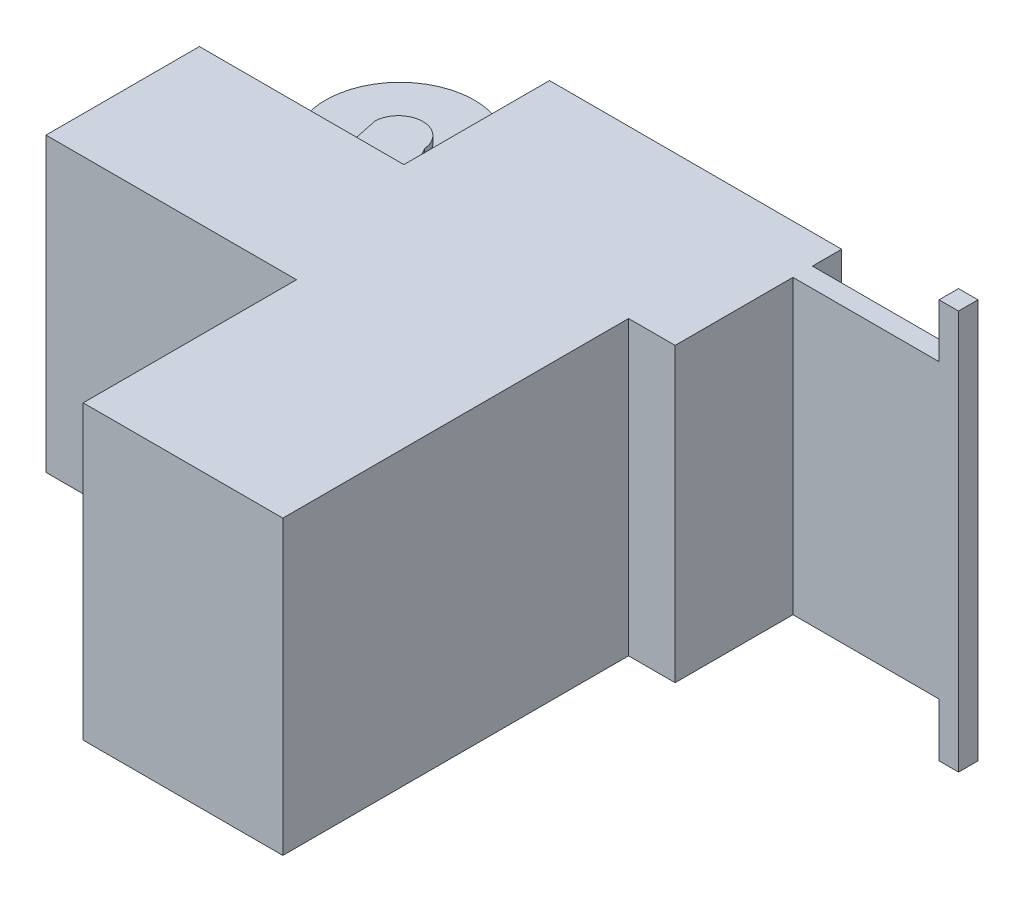
ISO-10303-21;
HEADER;
FILE_DESCRIPTION(('STEP AP214'),'2;1');
FILE_NAME('part.step','',(''),(''),'','','');
FILE_SCHEMA(('AUTOMOTIVE_DESIGN { 1 0 10303 214 1 1 1 1 }'));
ENDSEC;
DATA;
#1=APPLICATION_CONTEXT('core data for automotive mechanical design processes');
#2=APPLICATION_PROTOCOL_DEFINITION('international standard','automotive_design',2000,#1);
#3=PRODUCT_CONTEXT('',#1,'mechanical');
#4=PRODUCT('Part','Part','',(#3));
#5=PRODUCT_RELATED_PRODUCT_CATEGORY('part','',(#4));
#6=PRODUCT_DEFINITION_FORMATION('','',#4);
#7=PRODUCT_DEFINITION_CONTEXT('part definition',#1,'design');
#8=PRODUCT_DEFINITION('design','',#6,#7);
#9=PRODUCT_DEFINITION_SHAPE('','',#8);
#10=(LENGTH_UNIT() NAMED_UNIT(*) SI_UNIT(.MILLI.,.METRE.));
#11=(NAMED_UNIT(*) PLANE_ANGLE_UNIT() SI_UNIT($,.RADIAN.));
#12=(NAMED_UNIT(*) SI_UNIT($,.STERADIAN.) SOLID_ANGLE_UNIT());
#13=UNCERTAINTY_MEASURE_WITH_UNIT(LENGTH_MEASURE(1.E-05),#10,'distance_accuracy_value','');
#14=(GEOMETRIC_REPRESENTATION_CONTEXT(3) GLOBAL_UNCERTAINTY_ASSIGNED_CONTEXT((#13)) GLOBAL_UNIT_ASSIGNED_CONTEXT((#10,
#11,#12)) REPRESENTATION_CONTEXT('',''));
#15=CARTESIAN_POINT('',(0.,0.,0.));
#16=DIRECTION('',(0.,0.,1.));
#17=DIRECTION('',(1.,0.,0.));
#18=AXIS2_PLACEMENT_3D('',#15,#16,#17);
#19=CARTESIAN_POINT('',(-422.,-187.136600778184,-63.2222791750632));
#20=DIRECTION('',(0.,1.19069106426413E-12,-1.));
#21=DIRECTION('',(0.,1.,1.19069106426413E-12));
#22=AXIS2_PLACEMENT_3D('',#19,#20,#21);
#23=PLANE('',#22);
#24=DIRECTION('',(1.,0.,0.));
#25=VECTOR('',#24,1.);
#26=CARTESIAN_POINT('',(-422.,112.863399221816,-63.222279174706));
#27=LINE('',#26,#25);
#28=CARTESIAN_POINT('',(-422.,112.863399221816,-63.222279174706));
#29=VERTEX_POINT('',#28);
#30=CARTESIAN_POINT('',(-212.,112.863399221816,-63.2222791748846));
#31=VERTEX_POINT('',#30);
#32=EDGE_CURVE('E458',#29,#31,#27,.T.);
#33=ORIENTED_EDGE('',*,*,#32,.T.);
#34=DIRECTION('',(0.,-1.,-1.19069106426413E-12));
#35=VECTOR('',#34,1.);
#36=CARTESIAN_POINT('',(-212.,112.863399221816,-63.222279174706));
#37=LINE('',#36,#35);
#38=CARTESIAN_POINT('',(-212.,-187.136600778184,-63.2222791750632));
#39=VERTEX_POINT('',#38);
#40=EDGE_CURVE('E439',#31,#39,#37,.T.);
#41=ORIENTED_EDGE('',*,*,#40,.T.);
#42=DIRECTION('',(-1.,0.,0.));
#43=VECTOR('',#42,1.);
#44=CARTESIAN_POINT('',(-212.,-187.136600778184,-63.2222791750632));
#45=LINE('',#44,#43);
#46=CARTESIAN_POINT('',(-422.,-187.136600778184,-63.2222791750632));
#47=VERTEX_POINT('',#46);
#48=EDGE_CURVE('E433',#39,#47,#45,.T.);
#49=ORIENTED_EDGE('',*,*,#48,.T.);
#50=DIRECTION('',(0.,1.,1.19069106426413E-12));
#51=VECTOR('',#50,1.);
#52=CARTESIAN_POINT('',(-422.,-187.136600778184,-63.2222791750632));
#53=LINE('',#52,#51);
#54=EDGE_CURVE('E429',#47,#29,#53,.T.);
#55=ORIENTED_EDGE('',*,*,#54,.T.);
#56=EDGE_LOOP('',(#33,#41,#49,#55));
#57=FACE_BOUND('',#56,.T.);
#58=DIRECTION('',(0.,1.,1.1906985813992E-12));
#59=VECTOR('',#58,1.);
#60=CARTESIAN_POINT('',(-353.96039145,-37.1366007782101,-63.2222791748846));
#61=LINE('',#60,#59);
#62=CARTESIAN_POINT('',(-353.96039145,-97.13660077821,-63.2222791749561));
#63=VERTEX_POINT('',#62);
#64=CARTESIAN_POINT('',(-353.96039145,22.86339922179,-63.2222791748132));
#65=VERTEX_POINT('',#64);
#66=EDGE_CURVE('E1099',#63,#65,#61,.T.);
#67=ORIENTED_EDGE('',*,*,#66,.F.);
#68=DIRECTION('',(-1.,0.,0.));
#69=VECTOR('',#68,1.);
#70=CARTESIAN_POINT('',(-353.96039145,-97.1366007782101,-63.2222791749561));
#71=LINE('',#70,#69);
#72=CARTESIAN_POINT('',(-233.96039145,-97.1366007782101,-63.222279174956));
#73=VERTEX_POINT('',#72);
#74=EDGE_CURVE('E1097',#73,#63,#71,.T.);
#75=ORIENTED_EDGE('',*,*,#74,.F.);
#76=DIRECTION('',(0.,-1.,-1.1906985813992E-12));
#77=VECTOR('',#76,1.);
#78=CARTESIAN_POINT('',(-233.96039145,-97.1366007782101,-63.2222791749561));
#79=LINE('',#78,#77);
#80=CARTESIAN_POINT('',(-233.96039145,22.8633992218185,-63.2222791748132));
#81=VERTEX_POINT('',#80);
#82=EDGE_CURVE('E1080',#81,#73,#79,.T.);
#83=ORIENTED_EDGE('',*,*,#82,.F.);
#84=DIRECTION('',(1.,0.,0.));
#85=VECTOR('',#84,1.);
#86=CARTESIAN_POINT('',(-233.96039145,22.8633992217899,-63.2222791748132));
#87=LINE('',#86,#85);
#88=EDGE_CURVE('E405',#65,#81,#87,.T.);
#89=ORIENTED_EDGE('',*,*,#88,.F.);
#90=EDGE_LOOP('',(#67,#75,#83,#89));
#91=FACE_BOUND('',#90,.T.);
#92=ADVANCED_FACE('F45',(#57,#91),#23,.T.);
#93=CARTESIAN_POINT('',(88.,-187.136600778006,-212.722279175063));
#94=DIRECTION('',(0.,-1.1906985813992E-12,1.));
#95=DIRECTION('',(0.,-1.,-1.1906985813992E-12));
#96=AXIS2_PLACEMENT_3D('',#93,#94,#95);
#97=PLANE('',#96);
#98=DIRECTION('',(-1.,0.,0.));
#99=VECTOR('',#98,1.);
#100=CARTESIAN_POINT('',(88.,112.863399221994,-212.722279174706));
#101=LINE('',#100,#99);
#102=CARTESIAN_POINT('',(88.,112.863399221994,-212.722279174706));
#103=VERTEX_POINT('',#102);
#104=CARTESIAN_POINT('',(-212.,112.863399221994,-212.722279174706));
#105=VERTEX_POINT('',#104);
#106=EDGE_CURVE('E54',#103,#105,#101,.T.);
#107=ORIENTED_EDGE('',*,*,#106,.F.);
#108=DIRECTION('',(0.,1.,1.1906985813992E-12));
#109=VECTOR('',#108,1.);
#110=CARTESIAN_POINT('',(88.,-187.136600778006,-212.722279175063));
#111=LINE('',#110,#109);
#112=CARTESIAN_POINT('',(88.,-187.136600778006,-212.722279175063));
#113=VERTEX_POINT('',#112);
#114=EDGE_CURVE('E489',#113,#103,#111,.T.);
#115=ORIENTED_EDGE('',*,*,#114,.F.);
#116=DIRECTION('',(-1.,0.,0.));
#117=VECTOR('',#116,1.);
#118=CARTESIAN_POINT('',(88.,-187.136600778006,-212.722279175063));
#119=LINE('',#118,#117);
#120=CARTESIAN_POINT('',(-212.,-187.136600778006,-212.722279175063));
#121=VERTEX_POINT('',#120);
#122=EDGE_CURVE('E12',#113,#121,#119,.T.);
#123=ORIENTED_EDGE('',*,*,#122,.T.);
#124=DIRECTION('',(0.,1.,1.1906985813992E-12));
#125=VECTOR('',#124,1.);
#126=CARTESIAN_POINT('',(-212.,-187.136600778006,-212.722279175063));
#127=LINE('',#126,#125);
#128=EDGE_CURVE('E448',#121,#105,#127,.T.);
#129=ORIENTED_EDGE('',*,*,#128,.T.);
#130=EDGE_LOOP('',(#107,#115,#123,#129));
#131=FACE_BOUND('',#130,.T.);
#132=ADVANCED_FACE('F47',(#131),#97,.F.);
#133=CARTESIAN_POINT('',(-212.,-142.784345912705,-180.511144356607));
#134=DIRECTION('',(1.,0.,0.));
#135=DIRECTION('',(0.,1.,1.1906985813992E-12));
#136=AXIS2_PLACEMENT_3D('',#133,#134,#135);
#137=PLANE('',#136);
#138=ORIENTED_EDGE('',*,*,#40,.F.);
#139=DIRECTION('',(0.,-1.1906985813992E-12,1.));
#140=VECTOR('',#139,1.);
#141=CARTESIAN_POINT('',(-212.,112.86339922179,-41.722279174706));
#142=LINE('',#141,#140);
#143=EDGE_CURVE('E445',#105,#31,#142,.T.);
#144=ORIENTED_EDGE('',*,*,#143,.F.);
#145=ORIENTED_EDGE('',*,*,#128,.F.);
#146=DIRECTION('',(0.,1.19077973805304E-12,-1.));
#147=VECTOR('',#146,1.);
#148=CARTESIAN_POINT('',(-212.,-187.13660077821,-41.7222791750632));
#149=LINE('',#148,#147);
#150=EDGE_CURVE('E449',#39,#121,#149,.T.);
#151=ORIENTED_EDGE('',*,*,#150,.F.);
#152=EDGE_LOOP('',(#138,#144,#145,#151));
#153=FACE_BOUND('',#152,.T.);
#154=ADVANCED_FACE('F466',(#153),#137,.F.);
#155=CARTESIAN_POINT('',(88.,112.86339922179,-41.722279174706));
#156=DIRECTION('',(0.,-1.,-1.1906985813992E-12));
#157=DIRECTION('',(1.,0.,0.));
#158=AXIS2_PLACEMENT_3D('',#155,#156,#157);
#159=PLANE('',#158);
#160=ORIENTED_EDGE('',*,*,#143,.T.);
#161=ORIENTED_EDGE('',*,*,#32,.F.);
#162=DIRECTION('',(0.,1.1906985813992E-12,-1.));
#163=VECTOR('',#162,1.);
#164=CARTESIAN_POINT('',(-422.,112.86339922179,-41.722279174706));
#165=LINE('',#164,#163);
#166=CARTESIAN_POINT('',(-422.,112.863399221628,94.277720825294));
#167=VERTEX_POINT('',#166);
#168=EDGE_CURVE('E412',#167,#29,#165,.T.);
#169=ORIENTED_EDGE('',*,*,#168,.F.);
#170=DIRECTION('',(1.,0.,0.));
#171=VECTOR('',#170,1.);
#172=CARTESIAN_POINT('',(-422.,112.863399221628,94.277720825294));
#173=LINE('',#172,#171);
#174=CARTESIAN_POINT('',(-164.78992364,112.863399221628,94.277720825294));
#175=VERTEX_POINT('',#174);
#176=EDGE_CURVE('E414',#167,#175,#173,.T.);
#177=ORIENTED_EDGE('',*,*,#176,.T.);
#178=DIRECTION('',(0.,1.1906985813992E-12,-1.));
#179=VECTOR('',#178,1.);
#180=CARTESIAN_POINT('',(-164.78992364,112.863399221367,313.277720825294));
#181=LINE('',#180,#179);
#182=CARTESIAN_POINT('',(-164.78992364,112.863399221367,313.277720825294));
#183=VERTEX_POINT('',#182);
#184=EDGE_CURVE('E328',#183,#175,#181,.T.);
#185=ORIENTED_EDGE('',*,*,#184,.F.);
#186=DIRECTION('',(-1.,0.,0.));
#187=VECTOR('',#186,1.);
#188=CARTESIAN_POINT('',(-212.,112.863399221367,313.277720825294));
#189=LINE('',#188,#187);
#190=CARTESIAN_POINT('',(40.210077,112.863399221367,313.277720825294));
#191=VERTEX_POINT('',#190);
#192=EDGE_CURVE('E261',#191,#183,#189,.T.);
#193=ORIENTED_EDGE('',*,*,#192,.F.);
#194=DIRECTION('',(0.,1.1906985813992E-12,-1.));
#195=VECTOR('',#194,1.);
#196=CARTESIAN_POINT('',(40.210077,112.863399221367,313.277720825294));
#197=LINE('',#196,#195);
#198=CARTESIAN_POINT('',(40.210077,112.86339922179,-41.722279174706));
#199=VERTEX_POINT('',#198);
#200=EDGE_CURVE('E271',#191,#199,#197,.T.);
#201=ORIENTED_EDGE('',*,*,#200,.T.);
#202=DIRECTION('',(1.,0.,0.));
#203=VECTOR('',#202,1.);
#204=CARTESIAN_POINT('',(-422.,112.86339922179,-41.722279174706));
#205=LINE('',#204,#203);
#206=CARTESIAN_POINT('',(88.,112.86339922179,-41.722279174706));
#207=VERTEX_POINT('',#206);
#208=EDGE_CURVE('E286',#199,#207,#205,.T.);
#209=ORIENTED_EDGE('',*,*,#208,.T.);
#210=DIRECTION('',(0.,-1.1906985813992E-12,1.));
#211=VECTOR('',#210,1.);
#212=CARTESIAN_POINT('',(88.,112.86339922179,-41.722279174706));
#213=LINE('',#212,#211);
#214=CARTESIAN_POINT('',(88.,112.863399221934,-162.722279174706));
#215=VERTEX_POINT('',#214);
#216=EDGE_CURVE('E478',#215,#207,#213,.T.);
#217=ORIENTED_EDGE('',*,*,#216,.F.);
#218=DIRECTION('',(-1.,0.,0.));
#219=VECTOR('',#218,1.);
#220=CARTESIAN_POINT('',(258.,112.863399221934,-162.722279174706));
#221=LINE('',#220,#219);
#222=CARTESIAN_POINT('',(238.,112.863399221934,-162.722279174706));
#223=VERTEX_POINT('',#222);
#224=EDGE_CURVE('E520',#223,#215,#221,.T.);
#225=ORIENTED_EDGE('',*,*,#224,.F.);
#226=DIRECTION('',(0.,-1.1906985813992E-12,1.));
#227=VECTOR('',#226,1.);
#228=CARTESIAN_POINT('',(238.,112.863399221934,-162.722279174706));
#229=LINE('',#228,#227);
#230=CARTESIAN_POINT('',(238.,112.863399221958,-182.722279174706));
#231=VERTEX_POINT('',#230);
#232=EDGE_CURVE('E289',#231,#223,#229,.T.);
#233=ORIENTED_EDGE('',*,*,#232,.F.);
#234=DIRECTION('',(-1.,0.,0.));
#235=VECTOR('',#234,1.);
#236=CARTESIAN_POINT('',(258.,112.863399221958,-182.722279174706));
#237=LINE('',#236,#235);
#238=CARTESIAN_POINT('',(88.,112.863399221958,-182.722279174706));
#239=VERTEX_POINT('',#238);
#240=EDGE_CURVE('E313',#231,#239,#237,.T.);
#241=ORIENTED_EDGE('',*,*,#240,.T.);
#242=EDGE_CURVE('E488',#103,#239,#213,.T.);
#243=ORIENTED_EDGE('',*,*,#242,.F.);
#244=ORIENTED_EDGE('',*,*,#106,.T.);
#245=EDGE_LOOP('',(#160,#161,#169,#177,#185,#193,#201,#209,#217,#225,#233,#241,#243,#244));
#246=FACE_BOUND('',#245,.T.);
#247=ADVANCED_FACE('F467',(#246),#159,.F.);
#248=CARTESIAN_POINT('',(88.,-187.13660077821,-41.7222791750632));
#249=DIRECTION('',(0.,1.,1.19077973805304E-12));
#250=DIRECTION('',(0.,-1.19077973805304E-12,1.));
#251=AXIS2_PLACEMENT_3D('',#248,#249,#250);
#252=PLANE('',#251);
#253=ORIENTED_EDGE('',*,*,#122,.F.);
#254=DIRECTION('',(0.,1.19077973805304E-12,-1.));
#255=VECTOR('',#254,1.);
#256=CARTESIAN_POINT('',(88.,-187.13660077821,-41.7222791750632));
#257=LINE('',#256,#255);
#258=CARTESIAN_POINT('',(88.,-187.136600778042,-182.722279175063));
#259=VERTEX_POINT('',#258);
#260=EDGE_CURVE('E502',#259,#113,#257,.T.);
#261=ORIENTED_EDGE('',*,*,#260,.F.);
#262=DIRECTION('',(-1.,0.,0.));
#263=VECTOR('',#262,1.);
#264=CARTESIAN_POINT('',(258.,-187.136600778042,-182.722279175063));
#265=LINE('',#264,#263);
#266=CARTESIAN_POINT('',(238.,-187.136600778042,-182.722279175063));
#267=VERTEX_POINT('',#266);
#268=EDGE_CURVE('E519',#267,#259,#265,.T.);
#269=ORIENTED_EDGE('',*,*,#268,.F.);
#270=DIRECTION('',(0.,1.1906985813992E-12,-1.));
#271=VECTOR('',#270,1.);
#272=CARTESIAN_POINT('',(238.,-187.136600778042,-182.722279175063));
#273=LINE('',#272,#271);
#274=CARTESIAN_POINT('',(238.,-187.136600778066,-162.722279175063));
#275=VERTEX_POINT('',#274);
#276=EDGE_CURVE('E323',#275,#267,#273,.T.);
#277=ORIENTED_EDGE('',*,*,#276,.F.);
#278=DIRECTION('',(-1.,0.,0.));
#279=VECTOR('',#278,1.);
#280=CARTESIAN_POINT('',(258.,-187.136600778066,-162.722279175063));
#281=LINE('',#280,#279);
#282=CARTESIAN_POINT('',(88.,-187.136600778066,-162.722279175063));
#283=VERTEX_POINT('',#282);
#284=EDGE_CURVE('E537',#275,#283,#281,.T.);
#285=ORIENTED_EDGE('',*,*,#284,.T.);
#286=CARTESIAN_POINT('',(88.,-187.13660077821,-41.7222791750632));
#287=VERTEX_POINT('',#286);
#288=EDGE_CURVE('E499',#287,#283,#257,.T.);
#289=ORIENTED_EDGE('',*,*,#288,.F.);
#290=DIRECTION('',(-1.,0.,0.));
#291=VECTOR('',#290,1.);
#292=CARTESIAN_POINT('',(-212.,-187.13660077821,-41.7222791750632));
#293=LINE('',#292,#291);
#294=CARTESIAN_POINT('',(40.210077,-187.13660077821,-41.7222791750632));
#295=VERTEX_POINT('',#294);
#296=EDGE_CURVE('E268',#287,#295,#293,.T.);
#297=ORIENTED_EDGE('',*,*,#296,.T.);
#298=DIRECTION('',(0.,1.1906985813992E-12,-1.));
#299=VECTOR('',#298,1.);
#300=CARTESIAN_POINT('',(40.210077,-187.136600778633,313.277720824937));
#301=LINE('',#300,#299);
#302=CARTESIAN_POINT('',(40.210077,-187.136600778633,313.277720824937));
#303=VERTEX_POINT('',#302);
#304=EDGE_CURVE('E265',#303,#295,#301,.T.);
#305=ORIENTED_EDGE('',*,*,#304,.F.);
#306=DIRECTION('',(1.,0.,0.));
#307=VECTOR('',#306,1.);
#308=CARTESIAN_POINT('',(-212.,-187.136600778633,313.277720824937));
#309=LINE('',#308,#307);
#310=CARTESIAN_POINT('',(-164.78992364,-187.136600778633,313.277720824937));
#311=VERTEX_POINT('',#310);
#312=EDGE_CURVE('E251',#311,#303,#309,.T.);
#313=ORIENTED_EDGE('',*,*,#312,.F.);
#314=DIRECTION('',(0.,1.1906985813992E-12,-1.));
#315=VECTOR('',#314,1.);
#316=CARTESIAN_POINT('',(-164.78992364,-187.136600778633,313.277720824937));
#317=LINE('',#316,#315);
#318=CARTESIAN_POINT('',(-164.78992364,-187.136600778372,94.2777208251154));
#319=VERTEX_POINT('',#318);
#320=EDGE_CURVE('E330',#311,#319,#317,.T.);
#321=ORIENTED_EDGE('',*,*,#320,.T.);
#322=DIRECTION('',(1.,0.,0.));
#323=VECTOR('',#322,1.);
#324=CARTESIAN_POINT('',(-422.,-187.136600778372,94.2777208249368));
#325=LINE('',#324,#323);
#326=CARTESIAN_POINT('',(-422.,-187.136600778372,94.2777208249368));
#327=VERTEX_POINT('',#326);
#328=EDGE_CURVE('E426',#327,#319,#325,.T.);
#329=ORIENTED_EDGE('',*,*,#328,.F.);
#330=DIRECTION('',(0.,-1.1906985813992E-12,1.));
#331=VECTOR('',#330,1.);
#332=CARTESIAN_POINT('',(-422.,-187.13660077821,-41.7222791750632));
#333=LINE('',#332,#331);
#334=EDGE_CURVE('E406',#47,#327,#333,.T.);
#335=ORIENTED_EDGE('',*,*,#334,.F.);
#336=ORIENTED_EDGE('',*,*,#48,.F.);
#337=ORIENTED_EDGE('',*,*,#150,.T.);
#338=EDGE_LOOP('',(#253,#261,#269,#277,#285,#289,#297,#305,#313,#321,#329,#335,#336,#337));
#339=FACE_BOUND('',#338,.T.);
#340=ADVANCED_FACE('F266',(#339),#252,.F.);
#341=CARTESIAN_POINT('',(-422.,-187.136600778372,94.2777208249368));
#342=DIRECTION('',(0.,1.1906985813992E-12,-1.));
#343=DIRECTION('',(0.,1.,1.1906985813992E-12));
#344=AXIS2_PLACEMENT_3D('',#341,#342,#343);
#345=PLANE('',#344);
#346=DIRECTION('',(0.,1.,1.1906985813992E-12));
#347=VECTOR('',#346,1.);
#348=CARTESIAN_POINT('',(-164.78992364,-187.136600778372,94.2777208249368));
#349=LINE('',#348,#347);
#350=EDGE_CURVE('E410',#319,#175,#349,.T.);
#351=ORIENTED_EDGE('',*,*,#350,.T.);
#352=ORIENTED_EDGE('',*,*,#176,.F.);
#353=DIRECTION('',(0.,1.,1.1906985813992E-12));
#354=VECTOR('',#353,1.);
#355=CARTESIAN_POINT('',(-422.,-187.136600778372,94.2777208249368));
#356=LINE('',#355,#354);
#357=EDGE_CURVE('E409',#327,#167,#356,.T.);
#358=ORIENTED_EDGE('',*,*,#357,.F.);
#359=ORIENTED_EDGE('',*,*,#328,.T.);
#360=EDGE_LOOP('',(#351,#352,#358,#359));
#361=FACE_BOUND('',#360,.T.);
#362=ADVANCED_FACE('F473',(#361),#345,.F.);
#363=CARTESIAN_POINT('',(-422.,-142.784345912705,-180.511144356607));
#364=DIRECTION('',(-1.,0.,0.));
#365=DIRECTION('',(0.,-1.,-1.1906985813992E-12));
#366=AXIS2_PLACEMENT_3D('',#363,#364,#365);
#367=PLANE('',#366);
#368=ORIENTED_EDGE('',*,*,#334,.T.);
#369=ORIENTED_EDGE('',*,*,#357,.T.);
#370=ORIENTED_EDGE('',*,*,#168,.T.);
#371=ORIENTED_EDGE('',*,*,#54,.F.);
#372=EDGE_LOOP('',(#368,#369,#370,#371));
#373=FACE_BOUND('',#372,.T.);
#374=ADVANCED_FACE('F472',(#373),#367,.T.);
#375=CARTESIAN_POINT('',(-359.668875741474,-60.6366007780391,-206.800031294295));
#376=DIRECTION('',(0.,-1.,-1.1906985813992E-12));
#377=DIRECTION('',(1.,0.,0.));
#378=AXIS2_PLACEMENT_3D('',#375,#376,#377);
#379=PLANE('',#378);
#380=CARTESIAN_POINT('',(-359.668875741474,-60.6366007780391,-206.800031294295));
#381=DIRECTION('',(0.,-1.,-1.1906985813992E-12));
#382=DIRECTION('',(1.,0.,0.));
#383=AXIS2_PLACEMENT_3D('',#380,#381,#382);
#384=CIRCLE('',#383,76.5000000000001);
#385=CARTESIAN_POINT('',(-368.795458346077,-60.6366007781295,-130.846390894631));
#386=VERTEX_POINT('',#385);
#387=CARTESIAN_POINT('',(-304.68987647161,-60.6366007781024,-153.606426046255));
#388=VERTEX_POINT('',#387);
#389=EDGE_CURVE('E336',#386,#388,#384,.T.);
#390=ORIENTED_EDGE('',*,*,#389,.T.);
#391=DIRECTION('',(-0.488359358667634,1.03905432599198E-12,-0.87264261688376));
#392=VECTOR('',#391,1.);
#393=CARTESIAN_POINT('',(-334.695062032949,-60.6366007780386,-207.222279174913));
#394=LINE('',#393,#392);
#395=CARTESIAN_POINT('',(-334.695062032949,-60.6366007780386,-207.222279174913));
#396=VERTEX_POINT('',#395);
#397=EDGE_CURVE('E340',#388,#396,#394,.T.);
#398=ORIENTED_EDGE('',*,*,#397,.T.);
#399=CARTESIAN_POINT('',(-359.64268945,-60.6366007780409,-205.251245391471));
#400=DIRECTION('',(0.,1.,1.1906985813992E-12));
#401=DIRECTION('',(1.,0.,0.));
#402=AXIS2_PLACEMENT_3D('',#399,#400,#401);
#403=CIRCLE('',#402,25.0253688867013);
#404=CARTESIAN_POINT('',(-384.64268945,-60.6366007780396,-206.377783413676));
#405=VERTEX_POINT('',#404);
#406=EDGE_CURVE('E342',#396,#405,#403,.T.);
#407=ORIENTED_EDGE('',*,*,#406,.T.);
#408=DIRECTION('',(0.205339005116827,-1.16532587552583E-12,0.978690907783265));
#409=VECTOR('',#408,1.);
#410=CARTESIAN_POINT('',(-368.795458346077,-60.6366007781295,-130.846390894631));
#411=LINE('',#410,#409);
#412=EDGE_CURVE('E344',#405,#386,#411,.T.);
#413=ORIENTED_EDGE('',*,*,#412,.T.);
#414=EDGE_LOOP('',(#390,#398,#407,#413));
#415=FACE_BOUND('',#414,.T.);
#416=ADVANCED_FACE('F635',(#415),#379,.T.);
#417=CARTESIAN_POINT('',(-359.668875741474,-13.6366007780391,-206.800031294239));
#418=DIRECTION('',(0.,1.,1.1906985813992E-12));
#419=DIRECTION('',(-1.,0.,0.));
#420=AXIS2_PLACEMENT_3D('',#417,#418,#419);
#421=PLANE('',#420);
#422=CARTESIAN_POINT('',(-359.668875741474,-13.6366007780391,-206.800031294239));
#423=DIRECTION('',(0.,1.,1.1906985813992E-12));
#424=DIRECTION('',(-1.,0.,0.));
#425=AXIS2_PLACEMENT_3D('',#422,#423,#424);
#426=CIRCLE('',#425,76.5000000000001);
#427=CARTESIAN_POINT('',(-304.68987647161,-13.6366007781024,-153.606426046199));
#428=VERTEX_POINT('',#427);
#429=CARTESIAN_POINT('',(-368.795458346077,-13.6366007781295,-130.846390894575));
#430=VERTEX_POINT('',#429);
#431=EDGE_CURVE('E346',#428,#430,#426,.T.);
#432=ORIENTED_EDGE('',*,*,#431,.T.);
#433=DIRECTION('',(-0.205339005116827,1.16532587552583E-12,-0.978690907783265));
#434=VECTOR('',#433,1.);
#435=CARTESIAN_POINT('',(-368.795458346077,-13.6366007781295,-130.846390894575));
#436=LINE('',#435,#434);
#437=CARTESIAN_POINT('',(-384.64268945,-13.6366007780396,-206.377783413621));
#438=VERTEX_POINT('',#437);
#439=EDGE_CURVE('E349',#430,#438,#436,.T.);
#440=ORIENTED_EDGE('',*,*,#439,.T.);
#441=CARTESIAN_POINT('',(-359.64268945,-13.6366007780409,-205.251245391415));
#442=DIRECTION('',(0.,-1.,-1.1906985813992E-12));
#443=DIRECTION('',(-1.,0.,0.));
#444=AXIS2_PLACEMENT_3D('',#441,#442,#443);
#445=CIRCLE('',#444,25.0253688867013);
#446=CARTESIAN_POINT('',(-334.695062032949,-13.6366007780386,-207.222279174857));
#447=VERTEX_POINT('',#446);
#448=EDGE_CURVE('E351',#438,#447,#445,.T.);
#449=ORIENTED_EDGE('',*,*,#448,.T.);
#450=DIRECTION('',(0.488359358667634,-1.03905432599198E-12,0.87264261688376));
#451=VECTOR('',#450,1.);
#452=CARTESIAN_POINT('',(-304.68987647161,-13.6366007781024,-153.606426046199));
#453=LINE('',#452,#451);
#454=EDGE_CURVE('E353',#447,#428,#453,.T.);
#455=ORIENTED_EDGE('',*,*,#454,.T.);
#456=EDGE_LOOP('',(#432,#440,#449,#455));
#457=FACE_BOUND('',#456,.T.);
#458=ADVANCED_FACE('F637',(#457),#421,.T.);
#459=CARTESIAN_POINT('',(-359.668875741474,-68.1366007780391,-206.800031294303));
#460=DIRECTION('',(0.,1.,1.1906985813992E-12));
#461=DIRECTION('',(-1.,0.,0.));
#462=AXIS2_PLACEMENT_3D('',#459,#460,#461);
#463=CYLINDRICAL_SURFACE('',#462,76.5);
#464=DIRECTION('',(0.,1.,1.1906985813992E-12));
#465=VECTOR('',#464,1.);
#466=CARTESIAN_POINT('',(-304.68987647161,-68.1366007781024,-153.606426046264));
#467=LINE('',#466,#465);
#468=EDGE_CURVE('E355',#388,#428,#467,.T.);
#469=ORIENTED_EDGE('',*,*,#468,.F.);
#470=ORIENTED_EDGE('',*,*,#389,.F.);
#471=DIRECTION('',(0.,1.,1.1906985813992E-12));
#472=VECTOR('',#471,1.);
#473=CARTESIAN_POINT('',(-368.795458346077,-68.1366007781295,-130.84639089464));
#474=LINE('',#473,#472);
#475=EDGE_CURVE('E356',#386,#430,#474,.T.);
#476=ORIENTED_EDGE('',*,*,#475,.T.);
#477=ORIENTED_EDGE('',*,*,#431,.F.);
#478=EDGE_LOOP('',(#469,#470,#476,#477));
#479=FACE_BOUND('',#478,.T.);
#480=ADVANCED_FACE('F644',(#479),#463,.T.);
#481=CARTESIAN_POINT('',(-359.64268945,-68.1366007780409,-205.25124539148));
#482=DIRECTION('',(0.,1.,1.1906985813992E-12));
#483=DIRECTION('',(-1.,0.,0.));
#484=AXIS2_PLACEMENT_3D('',#481,#482,#483);
#485=CYLINDRICAL_SURFACE('',#484,25.0253688867013);
#486=DIRECTION('',(0.,1.,1.1906985813992E-12));
#487=VECTOR('',#486,1.);
#488=CARTESIAN_POINT('',(-384.64268945,-68.1366007780396,-206.377783413685));
#489=LINE('',#488,#487);
#490=CARTESIAN_POINT('',(-384.64268945,-68.1366007780396,-206.377783413685));
#491=VERTEX_POINT('',#490);
#492=EDGE_CURVE('E1133',#491,#405,#489,.T.);
#493=ORIENTED_EDGE('',*,*,#492,.T.);
#494=ORIENTED_EDGE('',*,*,#406,.F.);
#495=DIRECTION('',(0.,1.,1.1906985813992E-12));
#496=VECTOR('',#495,1.);
#497=CARTESIAN_POINT('',(-334.695062032949,-68.1366007780386,-207.222279174922));
#498=LINE('',#497,#496);
#499=CARTESIAN_POINT('',(-334.695062032949,-68.1366007780386,-207.222279174922));
#500=VERTEX_POINT('',#499);
#501=EDGE_CURVE('E1136',#500,#396,#498,.T.);
#502=ORIENTED_EDGE('',*,*,#501,.F.);
#503=CARTESIAN_POINT('',(-359.64268945,-68.1366007780409,-205.25124539148));
#504=DIRECTION('',(0.,1.,1.1906985813992E-12));
#505=DIRECTION('',(-1.,0.,0.));
#506=AXIS2_PLACEMENT_3D('',#503,#504,#505);
#507=CIRCLE('',#506,25.0253688867013);
#508=EDGE_CURVE('E368',#491,#500,#507,.F.);
#509=ORIENTED_EDGE('',*,*,#508,.F.);
#510=EDGE_LOOP('',(#493,#494,#502,#509));
#511=FACE_BOUND('',#510,.T.);
#512=ADVANCED_FACE('F651',(#511),#485,.T.);
#513=CARTESIAN_POINT('',(-334.695062032949,-6.13660077803857,-207.222279174848));
#514=VERTEX_POINT('',#513);
#515=EDGE_CURVE('E382',#447,#514,#498,.T.);
#516=ORIENTED_EDGE('',*,*,#515,.F.);
#517=ORIENTED_EDGE('',*,*,#448,.F.);
#518=CARTESIAN_POINT('',(-384.64268945,-6.1366007780396,-206.377783413612));
#519=VERTEX_POINT('',#518);
#520=EDGE_CURVE('E1135',#438,#519,#489,.T.);
#521=ORIENTED_EDGE('',*,*,#520,.T.);
#522=CARTESIAN_POINT('',(-359.64268945,-6.13660077804093,-205.251245391406));
#523=DIRECTION('',(0.,1.,1.1906985813992E-12));
#524=DIRECTION('',(-1.,0.,0.));
#525=AXIS2_PLACEMENT_3D('',#522,#523,#524);
#526=CIRCLE('',#525,25.0253688867013);
#527=EDGE_CURVE('E367',#519,#514,#526,.F.);
#528=ORIENTED_EDGE('',*,*,#527,.T.);
#529=EDGE_LOOP('',(#516,#517,#521,#528));
#530=FACE_BOUND('',#529,.T.);
#531=ADVANCED_FACE('F659',(#530),#485,.T.);
#532=CARTESIAN_POINT('',(-376.485829908265,-68.1366007780859,-167.500394945675));
#533=DIRECTION('',(-0.978690907783265,-2.44496862098528E-13,0.205339005116827));
#534=DIRECTION('',(-0.205339005116827,1.16532587552583E-12,-0.978690907783265));
#535=AXIS2_PLACEMENT_3D('',#532,#533,#534);
#536=PLANE('',#535);
#537=ORIENTED_EDGE('',*,*,#439,.F.);
#538=ORIENTED_EDGE('',*,*,#475,.F.);
#539=ORIENTED_EDGE('',*,*,#412,.F.);
#540=ORIENTED_EDGE('',*,*,#492,.F.);
#541=DIRECTION('',(0.205339005116827,-1.16532587552583E-12,0.978690907783265));
#542=VECTOR('',#541,1.);
#543=CARTESIAN_POINT('',(-376.485829908265,-68.1366007780859,-167.500394945675));
#544=LINE('',#543,#542);
#545=CARTESIAN_POINT('',(-359.64268945,-68.1366007781815,-87.2222791749215));
#546=VERTEX_POINT('',#545);
#547=EDGE_CURVE('E371',#491,#546,#544,.T.);
#548=ORIENTED_EDGE('',*,*,#547,.T.);
#549=DIRECTION('',(0.,1.,1.1906985813992E-12));
#550=VECTOR('',#549,1.);
#551=CARTESIAN_POINT('',(-359.64268945,-68.1366007781815,-87.2222791749215));
#552=LINE('',#551,#550);
#553=CARTESIAN_POINT('',(-359.64268945,-6.13660077818146,-87.2222791748477));
#554=VERTEX_POINT('',#553);
#555=EDGE_CURVE('E389',#546,#554,#552,.T.);
#556=ORIENTED_EDGE('',*,*,#555,.T.);
#557=DIRECTION('',(0.205339005116827,-1.16532587552583E-12,0.978690907783265));
#558=VECTOR('',#557,1.);
#559=CARTESIAN_POINT('',(-376.485829908265,-6.13660077808587,-167.500394945601));
#560=LINE('',#559,#558);
#561=EDGE_CURVE('E1129',#519,#554,#560,.T.);
#562=ORIENTED_EDGE('',*,*,#561,.F.);
#563=ORIENTED_EDGE('',*,*,#520,.F.);
#564=EDGE_LOOP('',(#537,#538,#539,#540,#548,#556,#562,#563));
#565=FACE_BOUND('',#564,.T.);
#566=ADVANCED_FACE('F668',(#565),#536,.T.);
#567=CARTESIAN_POINT('',(-334.695062032949,-139.136600778039,-207.222279175006));
#568=DIRECTION('',(-0.87264261688376,-5.81488795578573E-13,0.488359358667634));
#569=DIRECTION('',(-0.488359358667634,1.03905432599198E-12,-0.87264261688376));
#570=AXIS2_PLACEMENT_3D('',#567,#568,#569);
#571=PLANE('',#570);
#572=ORIENTED_EDGE('',*,*,#468,.T.);
#573=ORIENTED_EDGE('',*,*,#454,.F.);
#574=ORIENTED_EDGE('',*,*,#515,.T.);
#575=DIRECTION('',(0.488359358667634,-1.03905432599198E-12,0.87264261688376));
#576=VECTOR('',#575,1.);
#577=CARTESIAN_POINT('',(-334.695062032949,-6.13660077803857,-207.222279174848));
#578=LINE('',#577,#576);
#579=CARTESIAN_POINT('',(-267.539135991438,-6.13660077818146,-87.2222791748477));
#580=VERTEX_POINT('',#579);
#581=EDGE_CURVE('E358',#514,#580,#578,.T.);
#582=ORIENTED_EDGE('',*,*,#581,.T.);
#583=DIRECTION('',(0.,1.,1.1906985813992E-12));
#584=VECTOR('',#583,1.);
#585=CARTESIAN_POINT('',(-267.539135991438,-139.136600778182,-87.2222791750061));
#586=LINE('',#585,#584);
#587=CARTESIAN_POINT('',(-267.539135991438,-68.1366007781815,-87.2222791749215));
#588=VERTEX_POINT('',#587);
#589=EDGE_CURVE('E362',#588,#580,#586,.T.);
#590=ORIENTED_EDGE('',*,*,#589,.F.);
#591=DIRECTION('',(0.488359358667634,-1.03905432599198E-12,0.87264261688376));
#592=VECTOR('',#591,1.);
#593=CARTESIAN_POINT('',(-310.670360552946,-68.1366007780897,-164.292870743888));
#594=LINE('',#593,#592);
#595=EDGE_CURVE('E365',#500,#588,#594,.T.);
#596=ORIENTED_EDGE('',*,*,#595,.F.);
#597=ORIENTED_EDGE('',*,*,#501,.T.);
#598=ORIENTED_EDGE('',*,*,#397,.F.);
#599=EDGE_LOOP('',(#572,#573,#574,#582,#590,#596,#597,#598));
#600=FACE_BOUND('',#599,.T.);
#601=ADVANCED_FACE('F676',(#600),#571,.F.);
#602=CARTESIAN_POINT('',(-233.96039145,-68.1366007780386,-207.222279174922));
#603=DIRECTION('',(0.,1.,1.1906985813992E-12));
#604=DIRECTION('',(-1.,0.,0.));
#605=AXIS2_PLACEMENT_3D('',#602,#603,#604);
#606=PLANE('',#605);
#607=ORIENTED_EDGE('',*,*,#508,.T.);
#608=ORIENTED_EDGE('',*,*,#595,.T.);
#609=DIRECTION('',(-1.,0.,0.));
#610=VECTOR('',#609,1.);
#611=CARTESIAN_POINT('',(-233.96039145,-68.1366007781815,-87.2222791749215));
#612=LINE('',#611,#610);
#613=CARTESIAN_POINT('',(-353.96039145,-68.1366007781815,-87.2222791749215));
#614=VERTEX_POINT('',#613);
#615=EDGE_CURVE('E400',#588,#614,#612,.T.);
#616=ORIENTED_EDGE('',*,*,#615,.T.);
#617=DIRECTION('',(-1.,0.,0.));
#618=VECTOR('',#617,1.);
#619=CARTESIAN_POINT('',(-212.,-68.1366007781815,-87.2222791749215));
#620=LINE('',#619,#618);
#621=EDGE_CURVE('E374',#614,#546,#620,.T.);
#622=ORIENTED_EDGE('',*,*,#621,.T.);
#623=ORIENTED_EDGE('',*,*,#547,.F.);
#624=EDGE_LOOP('',(#607,#608,#616,#622,#623));
#625=FACE_BOUND('',#624,.T.);
#626=ADVANCED_FACE('F685',(#625),#606,.F.);
#627=CARTESIAN_POINT('',(-353.96039145,-6.13660077803857,-207.222279174848));
#628=DIRECTION('',(0.,-1.,-1.1906985813992E-12));
#629=DIRECTION('',(1.,0.,0.));
#630=AXIS2_PLACEMENT_3D('',#627,#628,#629);
#631=PLANE('',#630);
#632=DIRECTION('',(1.,0.,0.));
#633=VECTOR('',#632,1.);
#634=CARTESIAN_POINT('',(-353.96039145,-6.13660077818146,-87.2222791748477));
#635=LINE('',#634,#633);
#636=CARTESIAN_POINT('',(-353.96039145,-6.13660077818146,-87.2222791748477));
#637=VERTEX_POINT('',#636);
#638=EDGE_CURVE('E388',#637,#580,#635,.T.);
#639=ORIENTED_EDGE('',*,*,#638,.T.);
#640=ORIENTED_EDGE('',*,*,#581,.F.);
#641=ORIENTED_EDGE('',*,*,#527,.F.);
#642=ORIENTED_EDGE('',*,*,#561,.T.);
#643=DIRECTION('',(-1.,0.,0.));
#644=VECTOR('',#643,1.);
#645=CARTESIAN_POINT('',(-212.,-6.13660077818146,-87.2222791748477));
#646=LINE('',#645,#644);
#647=EDGE_CURVE('E372',#637,#554,#646,.T.);
#648=ORIENTED_EDGE('',*,*,#647,.F.);
#649=EDGE_LOOP('',(#639,#640,#641,#642,#648));
#650=FACE_BOUND('',#649,.T.);
#651=ADVANCED_FACE('F694',(#650),#631,.F.);
#652=CARTESIAN_POINT('',(-212.,-68.1366007781815,-87.2222791749215));
#653=DIRECTION('',(0.,1.1906985813992E-12,-1.));
#654=DIRECTION('',(0.,1.,1.1906985813992E-12));
#655=AXIS2_PLACEMENT_3D('',#652,#653,#654);
#656=PLANE('',#655);
#657=ORIENTED_EDGE('',*,*,#621,.F.);
#658=DIRECTION('',(0.,1.,1.1906985813992E-12));
#659=VECTOR('',#658,1.);
#660=CARTESIAN_POINT('',(-353.96039145,-37.1366007781815,-87.2222791748846));
#661=LINE('',#660,#659);
#662=EDGE_CURVE('E385',#614,#637,#661,.T.);
#663=ORIENTED_EDGE('',*,*,#662,.T.);
#664=ORIENTED_EDGE('',*,*,#647,.T.);
#665=ORIENTED_EDGE('',*,*,#555,.F.);
#666=EDGE_LOOP('',(#657,#663,#664,#665));
#667=FACE_BOUND('',#666,.T.);
#668=ADVANCED_FACE('F703',(#667),#656,.F.);
#669=CARTESIAN_POINT('',(-212.,-142.784345912841,-87.2222791750104));
#670=DIRECTION('',(0.,-1.1906985813992E-12,1.));
#671=DIRECTION('',(0.,-1.,-1.1906985813992E-12));
#672=AXIS2_PLACEMENT_3D('',#669,#670,#671);
#673=PLANE('',#672);
#674=ORIENTED_EDGE('',*,*,#638,.F.);
#675=DIRECTION('',(0.,1.,1.1906985813992E-12));
#676=VECTOR('',#675,1.);
#677=CARTESIAN_POINT('',(-353.96039145,22.8633992218185,-87.2222791748132));
#678=LINE('',#677,#676);
#679=CARTESIAN_POINT('',(-353.96039145,22.8633992218185,-87.2222791748132));
#680=VERTEX_POINT('',#679);
#681=EDGE_CURVE('E1100',#637,#680,#678,.T.);
#682=ORIENTED_EDGE('',*,*,#681,.T.);
#683=DIRECTION('',(1.,0.,0.));
#684=VECTOR('',#683,1.);
#685=CARTESIAN_POINT('',(-233.96039145,22.8633992218185,-87.2222791748132));
#686=LINE('',#685,#684);
#687=CARTESIAN_POINT('',(-233.96039145,22.8633992218185,-87.2222791748132));
#688=VERTEX_POINT('',#687);
#689=EDGE_CURVE('E1091',#680,#688,#686,.T.);
#690=ORIENTED_EDGE('',*,*,#689,.T.);
#691=DIRECTION('',(0.,-1.,-1.1906985813992E-12));
#692=VECTOR('',#691,1.);
#693=CARTESIAN_POINT('',(-233.96039145,-97.1366007781815,-87.222279174956));
#694=LINE('',#693,#692);
#695=CARTESIAN_POINT('',(-233.96039145,-97.1366007781815,-87.222279174956));
#696=VERTEX_POINT('',#695);
#697=EDGE_CURVE('E401',#688,#696,#694,.T.);
#698=ORIENTED_EDGE('',*,*,#697,.T.);
#699=DIRECTION('',(-1.,0.,0.));
#700=VECTOR('',#699,1.);
#701=CARTESIAN_POINT('',(-353.96039145,-97.1366007781815,-87.222279174956));
#702=LINE('',#701,#700);
#703=CARTESIAN_POINT('',(-353.96039145,-97.1366007781815,-87.222279174956));
#704=VERTEX_POINT('',#703);
#705=EDGE_CURVE('E1085',#696,#704,#702,.T.);
#706=ORIENTED_EDGE('',*,*,#705,.T.);
#707=EDGE_CURVE('E1105',#704,#614,#678,.T.);
#708=ORIENTED_EDGE('',*,*,#707,.T.);
#709=ORIENTED_EDGE('',*,*,#615,.F.);
#710=ORIENTED_EDGE('',*,*,#589,.T.);
#711=EDGE_LOOP('',(#674,#682,#690,#698,#706,#708,#709,#710));
#712=FACE_BOUND('',#711,.T.);
#713=ADVANCED_FACE('F712',(#712),#673,.F.);
#714=CARTESIAN_POINT('',(-353.96039145,-97.1366007781815,-87.222279174956));
#715=DIRECTION('',(0.,1.,1.1906985813992E-12));
#716=DIRECTION('',(-1.,0.,0.));
#717=AXIS2_PLACEMENT_3D('',#714,#715,#716);
#718=PLANE('',#717);
#719=ORIENTED_EDGE('',*,*,#74,.T.);
#720=DIRECTION('',(0.,-1.1906985813992E-12,1.));
#721=VECTOR('',#720,1.);
#722=CARTESIAN_POINT('',(-353.96039145,-97.1366007781815,-87.222279174956));
#723=LINE('',#722,#721);
#724=EDGE_CURVE('E1082',#704,#63,#723,.T.);
#725=ORIENTED_EDGE('',*,*,#724,.F.);
#726=ORIENTED_EDGE('',*,*,#705,.F.);
#727=DIRECTION('',(0.,-1.1906985813992E-12,1.));
#728=VECTOR('',#727,1.);
#729=CARTESIAN_POINT('',(-233.96039145,-97.1366007781815,-87.222279174956));
#730=LINE('',#729,#728);
#731=EDGE_CURVE('E1077',#696,#73,#730,.T.);
#732=ORIENTED_EDGE('',*,*,#731,.T.);
#733=EDGE_LOOP('',(#719,#725,#726,#732));
#734=FACE_BOUND('',#733,.T.);
#735=ADVANCED_FACE('F721',(#734),#718,.F.);
#736=CARTESIAN_POINT('',(-353.96039145,-37.1366007781815,-87.2222791748846));
#737=DIRECTION('',(1.,0.,0.));
#738=DIRECTION('',(0.,1.,1.1906985813992E-12));
#739=AXIS2_PLACEMENT_3D('',#736,#737,#738);
#740=PLANE('',#739);
#741=ORIENTED_EDGE('',*,*,#662,.F.);
#742=ORIENTED_EDGE('',*,*,#707,.F.);
#743=ORIENTED_EDGE('',*,*,#724,.T.);
#744=ORIENTED_EDGE('',*,*,#66,.T.);
#745=DIRECTION('',(0.,-1.1906985813992E-12,1.));
#746=VECTOR('',#745,1.);
#747=CARTESIAN_POINT('',(-353.96039145,22.8633992218185,-87.2222791748132));
#748=LINE('',#747,#746);
#749=EDGE_CURVE('E422',#680,#65,#748,.T.);
#750=ORIENTED_EDGE('',*,*,#749,.F.);
#751=ORIENTED_EDGE('',*,*,#681,.F.);
#752=EDGE_LOOP('',(#741,#742,#743,#744,#750,#751));
#753=FACE_BOUND('',#752,.T.);
#754=ADVANCED_FACE('F730',(#753),#740,.F.);
#755=CARTESIAN_POINT('',(-233.96039145,22.8633992218185,-87.2222791748132));
#756=DIRECTION('',(0.,-1.,-1.1906985813992E-12));
#757=DIRECTION('',(1.,0.,0.));
#758=AXIS2_PLACEMENT_3D('',#755,#756,#757);
#759=PLANE('',#758);
#760=ORIENTED_EDGE('',*,*,#88,.T.);
#761=DIRECTION('',(0.,-1.1906985813992E-12,1.));
#762=VECTOR('',#761,1.);
#763=CARTESIAN_POINT('',(-233.96039145,22.8633992218185,-87.2222791748132));
#764=LINE('',#763,#762);
#765=EDGE_CURVE('E62',#688,#81,#764,.T.);
#766=ORIENTED_EDGE('',*,*,#765,.F.);
#767=ORIENTED_EDGE('',*,*,#689,.F.);
#768=ORIENTED_EDGE('',*,*,#749,.T.);
#769=EDGE_LOOP('',(#760,#766,#767,#768));
#770=FACE_BOUND('',#769,.T.);
#771=ADVANCED_FACE('F739',(#770),#759,.F.);
#772=CARTESIAN_POINT('',(-233.96039145,-97.1366007781815,-87.222279174956));
#773=DIRECTION('',(-1.,0.,0.));
#774=DIRECTION('',(0.,-1.,-1.1906985813992E-12));
#775=AXIS2_PLACEMENT_3D('',#772,#773,#774);
#776=PLANE('',#775);
#777=ORIENTED_EDGE('',*,*,#731,.F.);
#778=ORIENTED_EDGE('',*,*,#697,.F.);
#779=ORIENTED_EDGE('',*,*,#765,.T.);
#780=ORIENTED_EDGE('',*,*,#82,.T.);
#781=EDGE_LOOP('',(#777,#778,#779,#780));
#782=FACE_BOUND('',#781,.T.);
#783=ADVANCED_FACE('F748',(#782),#776,.F.);
#784=CARTESIAN_POINT('',(-164.78992364,112.863399221628,94.277720825294));
#785=DIRECTION('',(-1.,0.,0.));
#786=DIRECTION('',(0.,-1.,0.));
#787=AXIS2_PLACEMENT_3D('',#784,#785,#786);
#788=PLANE('',#787);
#789=ORIENTED_EDGE('',*,*,#350,.F.);
#790=ORIENTED_EDGE('',*,*,#320,.F.);
#791=DIRECTION('',(0.,1.,1.1906985813992E-12));
#792=VECTOR('',#791,1.);
#793=CARTESIAN_POINT('',(-164.78992364,-142.784345913293,313.27772082499));
#794=LINE('',#793,#792);
#795=EDGE_CURVE('E258',#311,#183,#794,.T.);
#796=ORIENTED_EDGE('',*,*,#795,.T.);
#797=ORIENTED_EDGE('',*,*,#184,.T.);
#798=EDGE_LOOP('',(#789,#790,#796,#797));
#799=FACE_BOUND('',#798,.T.);
#800=ADVANCED_FACE('F475',(#799),#788,.T.);
#801=CARTESIAN_POINT('',(-212.,-142.784345913293,313.27772082499));
#802=DIRECTION('',(0.,-1.1906985813992E-12,1.));
#803=DIRECTION('',(0.,-1.,-1.1906985813992E-12));
#804=AXIS2_PLACEMENT_3D('',#801,#802,#803);
#805=PLANE('',#804);
#806=ORIENTED_EDGE('',*,*,#312,.T.);
#807=DIRECTION('',(0.,1.,1.1906985813992E-12));
#808=VECTOR('',#807,1.);
#809=CARTESIAN_POINT('',(40.210077,-142.784345913293,313.27772082499));
#810=LINE('',#809,#808);
#811=EDGE_CURVE('E255',#303,#191,#810,.T.);
#812=ORIENTED_EDGE('',*,*,#811,.T.);
#813=ORIENTED_EDGE('',*,*,#192,.T.);
#814=ORIENTED_EDGE('',*,*,#795,.F.);
#815=EDGE_LOOP('',(#806,#812,#813,#814));
#816=FACE_BOUND('',#815,.T.);
#817=ADVANCED_FACE('F253',(#816),#805,.T.);
#818=CARTESIAN_POINT('',(-212.,167.863399221955,-180.511144356237));
#819=DIRECTION('',(0.,-1.,-1.1906985813992E-12));
#820=DIRECTION('',(1.,0.,0.));
#821=AXIS2_PLACEMENT_3D('',#818,#819,#820);
#822=PLANE('',#821);
#823=DIRECTION('',(0.,1.1906985813992E-12,-1.));
#824=VECTOR('',#823,1.);
#825=CARTESIAN_POINT('',(258.,167.863399221958,-182.722279174641));
#826=LINE('',#825,#824);
#827=CARTESIAN_POINT('',(258.,167.863399221934,-162.722279174641));
#828=VERTEX_POINT('',#827);
#829=CARTESIAN_POINT('',(258.,167.863399221958,-182.722279174641));
#830=VERTEX_POINT('',#829);
#831=EDGE_CURVE('E294',#828,#830,#826,.T.);
#832=ORIENTED_EDGE('',*,*,#831,.T.);
#833=DIRECTION('',(-1.,0.,0.));
#834=VECTOR('',#833,1.);
#835=CARTESIAN_POINT('',(238.,167.863399221958,-182.722279174641));
#836=LINE('',#835,#834);
#837=CARTESIAN_POINT('',(238.,167.863399221958,-182.722279174641));
#838=VERTEX_POINT('',#837);
#839=EDGE_CURVE('E297',#830,#838,#836,.T.);
#840=ORIENTED_EDGE('',*,*,#839,.T.);
#841=DIRECTION('',(0.,-1.1906985813992E-12,1.));
#842=VECTOR('',#841,1.);
#843=CARTESIAN_POINT('',(238.,167.863399221934,-162.722279174641));
#844=LINE('',#843,#842);
#845=CARTESIAN_POINT('',(238.,167.863399221934,-162.722279174641));
#846=VERTEX_POINT('',#845);
#847=EDGE_CURVE('E299',#838,#846,#844,.T.);
#848=ORIENTED_EDGE('',*,*,#847,.T.);
#849=DIRECTION('',(1.,0.,0.));
#850=VECTOR('',#849,1.);
#851=CARTESIAN_POINT('',(258.,167.863399221934,-162.722279174641));
#852=LINE('',#851,#850);
#853=EDGE_CURVE('E301',#846,#828,#852,.T.);
#854=ORIENTED_EDGE('',*,*,#853,.T.);
#855=EDGE_LOOP('',(#832,#840,#848,#854));
#856=FACE_BOUND('',#855,.T.);
#857=ADVANCED_FACE('F581',(#856),#822,.F.);
#858=CARTESIAN_POINT('',(258.,-142.784345912705,-180.511144356607));
#859=DIRECTION('',(1.,0.,0.));
#860=DIRECTION('',(0.,1.,1.1906985813992E-12));
#861=AXIS2_PLACEMENT_3D('',#858,#859,#860);
#862=PLANE('',#861);
#863=DIRECTION('',(0.,1.,1.19071014622237E-12));
#864=VECTOR('',#863,1.);
#865=CARTESIAN_POINT('',(258.,-142.784345912726,-162.72227917501));
#866=LINE('',#865,#864);
#867=CARTESIAN_POINT('',(258.,-242.136600778066,-162.722279175129));
#868=VERTEX_POINT('',#867);
#869=EDGE_CURVE('E524',#868,#828,#866,.T.);
#870=ORIENTED_EDGE('',*,*,#869,.F.);
#871=DIRECTION('',(0.,-1.1906985813992E-12,1.));
#872=VECTOR('',#871,1.);
#873=CARTESIAN_POINT('',(258.,-242.136600778066,-162.722279175129));
#874=LINE('',#873,#872);
#875=CARTESIAN_POINT('',(258.,-242.136600778042,-182.722279175129));
#876=VERTEX_POINT('',#875);
#877=EDGE_CURVE('E307',#876,#868,#874,.T.);
#878=ORIENTED_EDGE('',*,*,#877,.F.);
#879=DIRECTION('',(0.,-1.,-1.19083735927727E-12));
#880=VECTOR('',#879,1.);
#881=CARTESIAN_POINT('',(258.,-142.784345912702,-182.72227917501));
#882=LINE('',#881,#880);
#883=EDGE_CURVE('E526',#830,#876,#882,.T.);
#884=ORIENTED_EDGE('',*,*,#883,.F.);
#885=ORIENTED_EDGE('',*,*,#831,.F.);
#886=EDGE_LOOP('',(#870,#878,#884,#885));
#887=FACE_BOUND('',#886,.T.);
#888=ADVANCED_FACE('F571',(#887),#862,.T.);
#889=CARTESIAN_POINT('',(-212.,-242.136600778045,-180.511144356725));
#890=DIRECTION('',(0.,1.,1.1906985813992E-12));
#891=DIRECTION('',(-1.,0.,0.));
#892=AXIS2_PLACEMENT_3D('',#889,#890,#891);
#893=PLANE('',#892);
#894=ORIENTED_EDGE('',*,*,#877,.T.);
#895=DIRECTION('',(-1.,0.,0.));
#896=VECTOR('',#895,1.);
#897=CARTESIAN_POINT('',(238.,-242.136600778066,-162.722279175129));
#898=LINE('',#897,#896);
#899=CARTESIAN_POINT('',(238.,-242.136600778066,-162.722279175129));
#900=VERTEX_POINT('',#899);
#901=EDGE_CURVE('E567',#868,#900,#898,.T.);
#902=ORIENTED_EDGE('',*,*,#901,.T.);
#903=DIRECTION('',(0.,1.1906985813992E-12,-1.));
#904=VECTOR('',#903,1.);
#905=CARTESIAN_POINT('',(238.,-242.136600778042,-182.722279175129));
#906=LINE('',#905,#904);
#907=CARTESIAN_POINT('',(238.,-242.136600778042,-182.722279175129));
#908=VERTEX_POINT('',#907);
#909=EDGE_CURVE('E563',#900,#908,#906,.T.);
#910=ORIENTED_EDGE('',*,*,#909,.T.);
#911=DIRECTION('',(1.,0.,0.));
#912=VECTOR('',#911,1.);
#913=CARTESIAN_POINT('',(258.,-242.136600778042,-182.722279175129));
#914=LINE('',#913,#912);
#915=EDGE_CURVE('E547',#908,#876,#914,.T.);
#916=ORIENTED_EDGE('',*,*,#915,.T.);
#917=EDGE_LOOP('',(#894,#902,#910,#916));
#918=FACE_BOUND('',#917,.T.);
#919=ADVANCED_FACE('F569',(#918),#893,.F.);
#920=CARTESIAN_POINT('',(238.,-242.136600778042,-182.722279175129));
#921=DIRECTION('',(1.,0.,0.));
#922=DIRECTION('',(0.,1.,1.1906985813992E-12));
#923=AXIS2_PLACEMENT_3D('',#920,#921,#922);
#924=PLANE('',#923);
#925=ORIENTED_EDGE('',*,*,#276,.T.);
#926=DIRECTION('',(0.,1.,1.1906985813992E-12));
#927=VECTOR('',#926,1.);
#928=CARTESIAN_POINT('',(238.,-242.136600778042,-182.722279175129));
#929=LINE('',#928,#927);
#930=EDGE_CURVE('E543',#908,#267,#929,.T.);
#931=ORIENTED_EDGE('',*,*,#930,.F.);
#932=ORIENTED_EDGE('',*,*,#909,.F.);
#933=DIRECTION('',(0.,1.,1.1906985813992E-12));
#934=VECTOR('',#933,1.);
#935=CARTESIAN_POINT('',(238.,-242.136600778066,-162.722279175129));
#936=LINE('',#935,#934);
#937=EDGE_CURVE('E528',#900,#275,#936,.T.);
#938=ORIENTED_EDGE('',*,*,#937,.T.);
#939=EDGE_LOOP('',(#925,#931,#932,#938));
#940=FACE_BOUND('',#939,.T.);
#941=ADVANCED_FACE('F578',(#940),#924,.F.);
#942=CARTESIAN_POINT('',(258.,-142.784345912702,-182.72227917501));
#943=DIRECTION('',(0.,1.19083735927727E-12,-1.));
#944=DIRECTION('',(0.,1.,1.19083735927727E-12));
#945=AXIS2_PLACEMENT_3D('',#942,#943,#944);
#946=PLANE('',#945);
#947=DIRECTION('',(0.,-1.,-1.19083735927727E-12));
#948=VECTOR('',#947,1.);
#949=CARTESIAN_POINT('',(88.,-142.784345912702,-182.72227917501));
#950=LINE('',#949,#948);
#951=EDGE_CURVE('E521',#239,#259,#950,.T.);
#952=ORIENTED_EDGE('',*,*,#951,.F.);
#953=ORIENTED_EDGE('',*,*,#240,.F.);
#954=DIRECTION('',(0.,-1.,-1.1906985813992E-12));
#955=VECTOR('',#954,1.);
#956=CARTESIAN_POINT('',(238.,167.863399221958,-182.722279174641));
#957=LINE('',#956,#955);
#958=EDGE_CURVE('E318',#838,#231,#957,.T.);
#959=ORIENTED_EDGE('',*,*,#958,.F.);
#960=ORIENTED_EDGE('',*,*,#839,.F.);
#961=ORIENTED_EDGE('',*,*,#883,.T.);
#962=ORIENTED_EDGE('',*,*,#915,.F.);
#963=ORIENTED_EDGE('',*,*,#930,.T.);
#964=ORIENTED_EDGE('',*,*,#268,.T.);
#965=EDGE_LOOP('',(#952,#953,#959,#960,#961,#962,#963,#964));
#966=FACE_BOUND('',#965,.T.);
#967=ADVANCED_FACE('F522',(#966),#946,.T.);
#968=CARTESIAN_POINT('',(238.,167.863399221934,-162.722279174641));
#969=DIRECTION('',(1.,0.,0.));
#970=DIRECTION('',(0.,1.,1.1906985813992E-12));
#971=AXIS2_PLACEMENT_3D('',#968,#969,#970);
#972=PLANE('',#971);
#973=ORIENTED_EDGE('',*,*,#232,.T.);
#974=DIRECTION('',(0.,-1.,-1.1906985813992E-12));
#975=VECTOR('',#974,1.);
#976=CARTESIAN_POINT('',(238.,167.863399221934,-162.722279174641));
#977=LINE('',#976,#975);
#978=EDGE_CURVE('E304',#846,#223,#977,.T.);
#979=ORIENTED_EDGE('',*,*,#978,.F.);
#980=ORIENTED_EDGE('',*,*,#847,.F.);
#981=ORIENTED_EDGE('',*,*,#958,.T.);
#982=EDGE_LOOP('',(#973,#979,#980,#981));
#983=FACE_BOUND('',#982,.T.);
#984=ADVANCED_FACE('F584',(#983),#972,.F.);
#985=CARTESIAN_POINT('',(258.,-142.784345912726,-162.72227917501));
#986=DIRECTION('',(0.,-1.19071014622237E-12,1.));
#987=DIRECTION('',(0.,-1.,-1.19071014622237E-12));
#988=AXIS2_PLACEMENT_3D('',#985,#986,#987);
#989=PLANE('',#988);
#990=DIRECTION('',(0.,1.,1.19071014622237E-12));
#991=VECTOR('',#990,1.);
#992=CARTESIAN_POINT('',(88.,-142.784345912726,-162.72227917501));
#993=LINE('',#992,#991);
#994=EDGE_CURVE('E487',#283,#215,#993,.T.);
#995=ORIENTED_EDGE('',*,*,#994,.F.);
#996=ORIENTED_EDGE('',*,*,#284,.F.);
#997=ORIENTED_EDGE('',*,*,#937,.F.);
#998=ORIENTED_EDGE('',*,*,#901,.F.);
#999=ORIENTED_EDGE('',*,*,#869,.T.);
#1000=ORIENTED_EDGE('',*,*,#853,.F.);
#1001=ORIENTED_EDGE('',*,*,#978,.T.);
#1002=ORIENTED_EDGE('',*,*,#224,.T.);
#1003=EDGE_LOOP('',(#995,#996,#997,#998,#999,#1000,#1001,#1002));
#1004=FACE_BOUND('',#1003,.T.);
#1005=ADVANCED_FACE('F576',(#1004),#989,.T.);
#1006=CARTESIAN_POINT('',(88.,-142.784345912705,-180.511144356607));
#1007=DIRECTION('',(1.,0.,0.));
#1008=DIRECTION('',(0.,1.,1.1906985813992E-12));
#1009=AXIS2_PLACEMENT_3D('',#1006,#1007,#1008);
#1010=PLANE('',#1009);
#1011=ORIENTED_EDGE('',*,*,#288,.T.);
#1012=ORIENTED_EDGE('',*,*,#994,.T.);
#1013=ORIENTED_EDGE('',*,*,#216,.T.);
#1014=DIRECTION('',(0.,-1.,-1.1906985813992E-12));
#1015=VECTOR('',#1014,1.);
#1016=CARTESIAN_POINT('',(88.,-187.13660077821,-41.7222791750632));
#1017=LINE('',#1016,#1015);
#1018=EDGE_CURVE('E334',#207,#287,#1017,.T.);
#1019=ORIENTED_EDGE('',*,*,#1018,.T.);
#1020=EDGE_LOOP('',(#1011,#1012,#1013,#1019));
#1021=FACE_BOUND('',#1020,.T.);
#1022=ADVANCED_FACE('F485',(#1021),#1010,.T.);
#1023=CARTESIAN_POINT('',(0.,4.9678344994216E-11,-41.7222791748404));
#1024=DIRECTION('',(0.,1.19069106426413E-12,-1.));
#1025=DIRECTION('',(0.,1.,1.19069106426413E-12));
#1026=AXIS2_PLACEMENT_3D('',#1023,#1024,#1025);
#1027=PLANE('',#1026);
#1028=DIRECTION('',(0.,1.,1.1906985813992E-12));
#1029=VECTOR('',#1028,1.);
#1030=CARTESIAN_POINT('',(40.210077,-142.78434591287,-41.7222791750104));
#1031=LINE('',#1030,#1029);
#1032=EDGE_CURVE('E275',#295,#199,#1031,.T.);
#1033=ORIENTED_EDGE('',*,*,#1032,.F.);
#1034=ORIENTED_EDGE('',*,*,#296,.F.);
#1035=ORIENTED_EDGE('',*,*,#1018,.F.);
#1036=ORIENTED_EDGE('',*,*,#208,.F.);
#1037=EDGE_LOOP('',(#1033,#1034,#1035,#1036));
#1038=FACE_BOUND('',#1037,.T.);
#1039=ADVANCED_FACE('F491',(#1038),#1027,.F.);
#1040=CARTESIAN_POINT('',(40.210077,-142.784345913293,313.27772082499));
#1041=DIRECTION('',(-1.,0.,0.));
#1042=DIRECTION('',(0.,-1.,-1.1906985813992E-12));
#1043=AXIS2_PLACEMENT_3D('',#1040,#1041,#1042);
#1044=PLANE('',#1043);
#1045=ORIENTED_EDGE('',*,*,#1032,.T.);
#1046=ORIENTED_EDGE('',*,*,#200,.F.);
#1047=ORIENTED_EDGE('',*,*,#811,.F.);
#1048=ORIENTED_EDGE('',*,*,#304,.T.);
#1049=EDGE_LOOP('',(#1045,#1046,#1047,#1048));
#1050=FACE_BOUND('',#1049,.T.);
#1051=ADVANCED_FACE('F273',(#1050),#1044,.F.);
#1052=ORIENTED_EDGE('',*,*,#242,.T.);
#1053=ORIENTED_EDGE('',*,*,#951,.T.);
#1054=ORIENTED_EDGE('',*,*,#260,.T.);
#1055=ORIENTED_EDGE('',*,*,#114,.T.);
#1056=EDGE_LOOP('',(#1052,#1053,#1054,#1055));
#1057=FACE_BOUND('',#1056,.T.);
#1058=ADVANCED_FACE('F512',(#1057),#1010,.T.);
#1059=CLOSED_SHELL('',(#92,#132,#154,#247,#340,#362,#374,#416,#458,#480,#512,#531,#566,#601,
#626,#651,#668,#713,#735,#754,#771,#783,#800,#817,#857,#888,#919,#941,#967,#984,#1005,#1022,
#1039,#1051,#1058));
#1060=MANIFOLD_SOLID_BREP('B2',#1059);
#1061=ADVANCED_BREP_SHAPE_REPRESENTATION('',(#18,#1060),#14);
#1062=SHAPE_DEFINITION_REPRESENTATION(#9,#1061);
ENDSEC;
END-ISO-10303-21;
